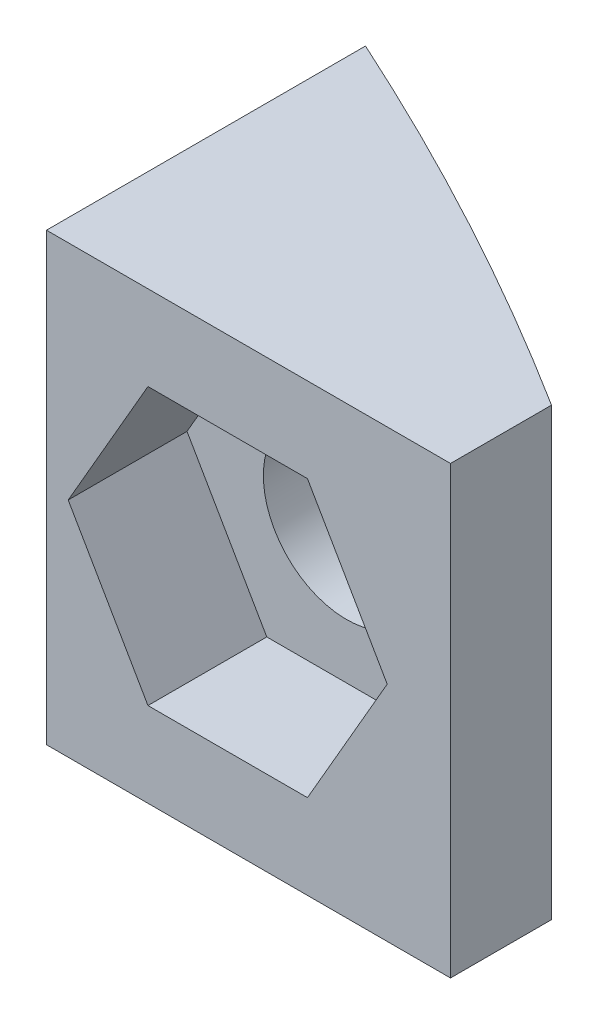
ISO-10303-21;
HEADER;
FILE_DESCRIPTION(('STEP AP214'),'2;1');
FILE_NAME('part.step','',(''),(''),'','','');
FILE_SCHEMA(('AUTOMOTIVE_DESIGN { 1 0 10303 214 1 1 1 1 }'));
ENDSEC;
DATA;
#1=APPLICATION_CONTEXT('core data for automotive mechanical design processes');
#2=APPLICATION_PROTOCOL_DEFINITION('international standard','automotive_design',2000,#1);
#3=PRODUCT_CONTEXT('',#1,'mechanical');
#4=PRODUCT('Part','Part','',(#3));
#5=PRODUCT_RELATED_PRODUCT_CATEGORY('part','',(#4));
#6=PRODUCT_DEFINITION_FORMATION('','',#4);
#7=PRODUCT_DEFINITION_CONTEXT('part definition',#1,'design');
#8=PRODUCT_DEFINITION('design','',#6,#7);
#9=PRODUCT_DEFINITION_SHAPE('','',#8);
#10=(LENGTH_UNIT() NAMED_UNIT(*) SI_UNIT(.MILLI.,.METRE.));
#11=(NAMED_UNIT(*) PLANE_ANGLE_UNIT() SI_UNIT($,.RADIAN.));
#12=(NAMED_UNIT(*) SI_UNIT($,.STERADIAN.) SOLID_ANGLE_UNIT());
#13=UNCERTAINTY_MEASURE_WITH_UNIT(LENGTH_MEASURE(1.E-05),#10,'distance_accuracy_value','');
#14=(GEOMETRIC_REPRESENTATION_CONTEXT(3) GLOBAL_UNCERTAINTY_ASSIGNED_CONTEXT((#13)) GLOBAL_UNIT_ASSIGNED_CONTEXT((#10,
#11,#12)) REPRESENTATION_CONTEXT('',''));
#15=CARTESIAN_POINT('',(0.,0.,0.));
#16=DIRECTION('',(0.,0.,1.));
#17=DIRECTION('',(1.,0.,0.));
#18=AXIS2_PLACEMENT_3D('',#15,#16,#17);
#19=CARTESIAN_POINT('',(77.47,19.05,0.));
#20=DIRECTION('',(-1.,0.,0.));
#21=DIRECTION('',(0.,0.,1.));
#22=AXIS2_PLACEMENT_3D('',#19,#20,#21);
#23=PLANE('',#22);
#24=DIRECTION('',(0.,0.,-1.));
#25=VECTOR('',#24,1.);
#26=CARTESIAN_POINT('',(77.47,0.,0.));
#27=LINE('',#26,#25);
#28=CARTESIAN_POINT('',(77.47,0.,-118.592544885295));
#29=VERTEX_POINT('',#28);
#30=CARTESIAN_POINT('',(77.47,0.,-122.910544885295));
#31=VERTEX_POINT('',#30);
#32=EDGE_CURVE('E196',#29,#31,#27,.T.);
#33=ORIENTED_EDGE('',*,*,#32,.T.);
#34=DIRECTION('',(0.,-1.,0.));
#35=VECTOR('',#34,1.);
#36=CARTESIAN_POINT('',(77.47,19.05,-122.910544885295));
#37=LINE('',#36,#35);
#38=CARTESIAN_POINT('',(77.47,19.05,-122.910544885295));
#39=VERTEX_POINT('',#38);
#40=EDGE_CURVE('E11',#39,#31,#37,.T.);
#41=ORIENTED_EDGE('',*,*,#40,.F.);
#42=DIRECTION('',(0.,0.,-1.));
#43=VECTOR('',#42,1.);
#44=CARTESIAN_POINT('',(77.47,19.05,0.));
#45=LINE('',#44,#43);
#46=CARTESIAN_POINT('',(77.47,19.05,-118.592544885295));
#47=VERTEX_POINT('',#46);
#48=EDGE_CURVE('E208',#47,#39,#45,.T.);
#49=ORIENTED_EDGE('',*,*,#48,.F.);
#50=DIRECTION('',(0.,-1.,0.));
#51=VECTOR('',#50,1.);
#52=CARTESIAN_POINT('',(77.47,19.05,-118.592544885295));
#53=LINE('',#52,#51);
#54=EDGE_CURVE('E219',#47,#29,#53,.T.);
#55=ORIENTED_EDGE('',*,*,#54,.T.);
#56=EDGE_LOOP('',(#33,#41,#49,#55));
#57=FACE_BOUND('',#56,.T.);
#58=ADVANCED_FACE('F41',(#57),#23,.F.);
#59=CARTESIAN_POINT('',(0.,19.05,0.));
#60=DIRECTION('',(0.,-1.,0.));
#61=DIRECTION('',(0.,0.,-1.));
#62=AXIS2_PLACEMENT_3D('',#59,#60,#61);
#63=CYLINDRICAL_SURFACE('',#62,145.288);
#64=CARTESIAN_POINT('',(71.5010000000001,9.525,-126.476124003703));
#65=CARTESIAN_POINT('',(71.5010001649069,9.43439620532657,-126.476123905078));
#66=CARTESIAN_POINT('',(71.4975333264599,9.34379474596496,-126.47808401275));
#67=CARTESIAN_POINT('',(71.4837113289169,9.16325660146624,-126.485896531519));
#68=CARTESIAN_POINT('',(71.4733537083806,9.07332016549213,-126.491750333473));
#69=CARTESIAN_POINT('',(71.4458634301493,8.89471383538347,-126.507279604646));
#70=CARTESIAN_POINT('',(71.4287230038121,8.80604551475931,-126.51695945599));
#71=CARTESIAN_POINT('',(71.3878907547201,8.63070749468394,-126.54000371741));
#72=CARTESIAN_POINT('',(71.3641963169206,8.54403860799085,-126.553369598203));
#73=CARTESIAN_POINT('',(71.2838802446895,8.28858846625354,-126.598638106663));
#74=CARTESIAN_POINT('',(71.2178985092768,8.12355543040999,-126.635783766397));
#75=CARTESIAN_POINT('',(71.0638760449247,7.80782916574315,-126.722279862364));
#76=CARTESIAN_POINT('',(70.9758369128121,7.65713489996581,-126.771629415102));
#77=CARTESIAN_POINT('',(70.7757713472534,7.36518932908249,-126.883438269608));
#78=CARTESIAN_POINT('',(70.6627295296353,7.22484691986981,-126.946449119097));
#79=CARTESIAN_POINT('',(70.4195018468284,6.96498051430025,-127.081533130596));
#80=CARTESIAN_POINT('',(70.2893089769108,6.84546507054279,-127.153609994745));
#81=CARTESIAN_POINT('',(69.9984161632448,6.61516858632744,-127.314003475861));
#82=CARTESIAN_POINT('',(69.8359335830389,6.50727116994737,-127.40322708678));
#83=CARTESIAN_POINT('',(69.4982947335074,6.32036309442201,-127.587722939857));
#84=CARTESIAN_POINT('',(69.3231319545769,6.24136740028041,-127.682998285662));
#85=CARTESIAN_POINT('',(68.9432897329711,6.10537570580403,-127.888535640588));
#86=CARTESIAN_POINT('',(68.7375489381928,6.05201476973421,-127.999250503989));
#87=CARTESIAN_POINT('',(68.3206521108633,5.98258429177211,-128.222257768132));
#88=CARTESIAN_POINT('',(68.1094938521993,5.96653033626387,-128.334550808513));
#89=CARTESIAN_POINT('',(67.6732945183996,5.97226455434364,-128.565130765425));
#90=CARTESIAN_POINT('',(67.4482395014602,5.99656935293641,-128.683335195357));
#91=CARTESIAN_POINT('',(67.0042731023401,6.08821895130764,-128.915060821574));
#92=CARTESIAN_POINT('',(66.7853624297083,6.15556870074474,-129.028581477683));
#93=CARTESIAN_POINT('',(66.4690596846984,6.28778384480003,-129.191644451788));
#94=CARTESIAN_POINT('',(66.3663826512842,6.33656113789001,-129.244415828261));
#95=CARTESIAN_POINT('',(66.165253530753,6.444313206469,-129.347496626411));
#96=CARTESIAN_POINT('',(66.0667993577092,6.50328287320217,-129.397807265361));
#97=CARTESIAN_POINT('',(65.8750724005428,6.63124357098046,-129.495518745455));
#98=CARTESIAN_POINT('',(65.7818003267962,6.70023597130559,-129.542919187755));
#99=CARTESIAN_POINT('',(65.6015314384539,6.8479020318045,-129.634301860454));
#100=CARTESIAN_POINT('',(65.5145308777145,6.92656983530794,-129.678286132661));
#101=CARTESIAN_POINT('',(65.3552627299218,7.08575396075117,-129.758621351409));
#102=CARTESIAN_POINT('',(65.2823731002517,7.16548137255203,-129.795303248619));
#103=CARTESIAN_POINT('',(65.1435178003256,7.33215047929023,-129.865049440799));
#104=CARTESIAN_POINT('',(65.0775482905224,7.41908812524978,-129.898115742277));
#105=CARTESIAN_POINT('',(64.9533482900191,7.59960301464737,-129.960264362442));
#106=CARTESIAN_POINT('',(64.8951142171106,7.69317715377503,-129.989348525414));
#107=CARTESIAN_POINT('',(64.7871535607639,7.8862890746596,-130.043190207701));
#108=CARTESIAN_POINT('',(64.7374258727285,7.98582607983817,-130.067948288788));
#109=CARTESIAN_POINT('',(64.6524773126145,8.17809459477088,-130.110192153503));
#110=CARTESIAN_POINT('',(64.6162410509,8.27026652931755,-130.128189271929));
#111=CARTESIAN_POINT('',(64.551431661269,8.45791094602536,-130.160350817961));
#112=CARTESIAN_POINT('',(64.5228576274202,8.55338303648916,-130.174515698668));
#113=CARTESIAN_POINT('',(64.4737564294839,8.74682433517989,-130.198841882656));
#114=CARTESIAN_POINT('',(64.4532253315,8.84479229760998,-130.20900514319));
#115=CARTESIAN_POINT('',(64.4204706939571,9.04244266290864,-130.225213516225));
#116=CARTESIAN_POINT('',(64.4082466661012,9.14212496465363,-130.231258870781));
#117=CARTESIAN_POINT('',(64.3929617120548,9.33372225325172,-130.238817140475));
#118=CARTESIAN_POINT('',(64.3892037977646,9.42556881438923,-130.240674822451));
#119=CARTESIAN_POINT('',(64.3888122699759,9.60931336192651,-130.240868388693));
#120=CARTESIAN_POINT('',(64.3921811027179,9.70121135515597,-130.239203063694));
#121=CARTESIAN_POINT('',(64.4060082269324,9.88429347525144,-130.232365829274));
#122=CARTESIAN_POINT('',(64.4164625387237,9.97547797379776,-130.22719588828));
#123=CARTESIAN_POINT('',(64.4443258938586,10.1565242222909,-130.21340958738));
#124=CARTESIAN_POINT('',(64.4617375217101,10.2463854677981,-130.204791946719));
#125=CARTESIAN_POINT('',(64.5232538989719,10.5091757417874,-130.174324574542));
#126=CARTESIAN_POINT('',(64.5769667074944,10.6794244432042,-130.147699682908));
#127=CARTESIAN_POINT('',(64.708122052126,11.0079400605016,-130.082539913609));
#128=CARTESIAN_POINT('',(64.7855676550899,11.1662054245451,-130.04400349668));
#129=CARTESIAN_POINT('',(64.9651291319094,11.4739972807232,-129.954397411063));
#130=CARTESIAN_POINT('',(65.0681700158054,11.6228461608776,-129.902856285728));
#131=CARTESIAN_POINT('',(65.2932883057748,11.9010526910054,-129.789850504962));
#132=CARTESIAN_POINT('',(65.415371894678,12.0304039835399,-129.72838262626));
#133=CARTESIAN_POINT('',(65.6864550075499,12.2783207624698,-129.59134843373));
#134=CARTESIAN_POINT('',(65.8368838442377,12.394896359386,-129.515013747476));
#135=CARTESIAN_POINT('',(66.1513649889434,12.6012689484117,-129.354671511299));
#136=CARTESIAN_POINT('',(66.3154230202549,12.6910546172431,-129.270660736471));
#137=CARTESIAN_POINT('',(66.6710972803871,12.8513055561133,-129.087612968502));
#138=CARTESIAN_POINT('',(66.86378185993,12.918665047743,-128.987930822553));
#139=CARTESIAN_POINT('',(67.2555606330689,13.0193909936629,-128.784088111445));
#140=CARTESIAN_POINT('',(67.4546576512966,13.0527422503379,-128.679925565731));
#141=CARTESIAN_POINT('',(67.8726398377826,13.0869852501667,-128.459987189422));
#142=CARTESIAN_POINT('',(68.091687521059,13.0846718095844,-128.344012430674));
#143=CARTESIAN_POINT('',(68.5260492840664,13.0399973100467,-128.112622824257));
#144=CARTESIAN_POINT('',(68.7413620048214,12.9976219733057,-127.997208190952));
#145=CARTESIAN_POINT('',(69.1695763657749,12.8712056026983,-127.766325018161));
#146=CARTESIAN_POINT('',(69.3821477385868,12.7857983110478,-127.65098778599));
#147=CARTESIAN_POINT('',(69.7903630517223,12.5733749258898,-127.428262676174));
#148=CARTESIAN_POINT('',(69.9860085428673,12.446362649523,-127.320874070372));
#149=CARTESIAN_POINT('',(70.2559677680123,12.2299976830025,-127.171977732119));
#150=CARTESIAN_POINT('',(70.340045052991,12.1558937954212,-127.125487564198));
#151=CARTESIAN_POINT('',(70.5017014008884,11.9990793761614,-127.035906498451));
#152=CARTESIAN_POINT('',(70.5792842150748,11.9163738756375,-126.992813639157));
#153=CARTESIAN_POINT('',(70.7270156066197,11.7427735770519,-126.91059596123));
#154=CARTESIAN_POINT('',(70.7971651548062,11.6518798512964,-126.871470624444));
#155=CARTESIAN_POINT('',(70.9290667534942,11.4624701724884,-126.797776555968));
#156=CARTESIAN_POINT('',(70.9908204838554,11.3639557504143,-126.763206912804));
#157=CARTESIAN_POINT('',(71.0978936270582,11.1726895441951,-126.703179739834));
#158=CARTESIAN_POINT('',(71.1443010872469,11.0807333064635,-126.677123987172));
#159=CARTESIAN_POINT('',(71.2292932587019,10.8922015814637,-126.629353247462));
#160=CARTESIAN_POINT('',(71.2678795200955,10.7956270142267,-126.607637400276));
#161=CARTESIAN_POINT('',(71.3365784116261,10.5988556032812,-126.568941994415));
#162=CARTESIAN_POINT('',(71.3667111415641,10.4986680020807,-126.551951201924));
#163=CARTESIAN_POINT('',(71.4181268802958,10.2953941125337,-126.52294247004));
#164=CARTESIAN_POINT('',(71.4394148686866,10.1923094902121,-126.510921732521));
#165=CARTESIAN_POINT('',(71.471001501924,9.9954189696889,-126.493079567178));
#166=CARTESIAN_POINT('',(71.4822370094727,9.90180993777668,-126.486729772708));
#167=CARTESIAN_POINT('',(71.4972361497104,9.71379975566086,-126.478252055283));
#168=CARTESIAN_POINT('',(71.5009998281864,9.61939861031484,-126.476124106458));
#169=CARTESIAN_POINT('',(71.5010000000001,9.525,-126.476124003703));
#170=B_SPLINE_CURVE_WITH_KNOTS('',3,(#64,#65,#66,#67,#68,#69,#70,#71,#72,#73,#74,#75,#76,#77,
#78,#79,#80,#81,#82,#83,#84,#85,#86,#87,#88,#89,#90,#91,#92,#93,#94,#95,#96,#97,#98,#99,#100,
#101,#102,#103,#104,#105,#106,#107,#108,#109,#110,#111,#112,#113,#114,#115,#116,#117,#118,#119,
#120,#121,#122,#123,#124,#125,#126,#127,#128,#129,#130,#131,#132,#133,#134,#135,#136,#137,#138,
#139,#140,#141,#142,#143,#144,#145,#146,#147,#148,#149,#150,#151,#152,#153,#154,#155,#156,#157,
#158,#159,#160,#161,#162,#163,#164,#165,#166,#167,#168,#169),.UNSPECIFIED.,.T.,.F.,(4,2,2,2,2,2,
2,2,2,2,2,2,2,2,2,2,2,2,2,2,2,2,2,2,2,2,2,2,2,2,2,2,2,2,2,2,2,2,2,2,2,2,2,2,2,2,2,2,2,2,2,2,4),
(0.,0.271719761315062,0.543536635171826,0.815665737984637,1.0879035770804,1.62994644803964,
2.17195008959383,2.74236147546937,3.31300655176737,3.95385807923089,4.59504096473342,
5.31092087290789,6.02709981291393,6.78963411567533,7.55225611661373,7.92781778572121,
8.30319175388762,8.67861705298896,9.0538162096141,9.39559272678117,9.73717859893857,
10.0786057302661,10.4199884918381,10.7215694642246,11.0231147638819,11.3245123894158,
11.6258922970005,11.9013804085138,12.1769630960646,12.452391125996,12.7279215673633,
13.2667525795589,13.8056532512222,14.3679480289913,14.9304257554286,15.5430531349073,
16.1559390875123,16.834571361364,17.5135067699773,18.2537878084265,18.9943327774655,
19.7600297352774,20.5256564622055,20.8892305610238,21.2525931857346,21.6159082945187,
21.9791506028389,22.2974413469714,22.6156689454613,22.9331333604604,23.2504187997307,
23.5335209053184,23.8166212760663),.UNSPECIFIED.);
#171=CARTESIAN_POINT('',(71.5010000000001,9.525,-126.476124003703));
#172=VERTEX_POINT('',#171);
#173=EDGE_CURVE('E159',#172,#172,#170,.T.);
#174=ORIENTED_EDGE('',*,*,#173,.F.);
#175=EDGE_LOOP('',(#174));
#176=FACE_BOUND('',#175,.T.);
#177=CARTESIAN_POINT('',(0.,0.,0.));
#178=DIRECTION('',(0.,1.,0.));
#179=DIRECTION('',(0.,0.,1.));
#180=AXIS2_PLACEMENT_3D('',#177,#178,#179);
#181=CIRCLE('',#180,145.288);
#182=CARTESIAN_POINT('',(60.198,0.,-132.230116614938));
#183=VERTEX_POINT('',#182);
#184=EDGE_CURVE('E223',#31,#183,#181,.T.);
#185=ORIENTED_EDGE('',*,*,#184,.T.);
#186=DIRECTION('',(0.,-1.,0.));
#187=VECTOR('',#186,1.);
#188=CARTESIAN_POINT('',(60.198,19.05,-132.230116614938));
#189=LINE('',#188,#187);
#190=CARTESIAN_POINT('',(60.198,19.05,-132.230116614938));
#191=VERTEX_POINT('',#190);
#192=EDGE_CURVE('E50',#191,#183,#189,.T.);
#193=ORIENTED_EDGE('',*,*,#192,.F.);
#194=CARTESIAN_POINT('',(0.,19.05,0.));
#195=DIRECTION('',(0.,1.,0.));
#196=DIRECTION('',(0.,0.,1.));
#197=AXIS2_PLACEMENT_3D('',#194,#195,#196);
#198=CIRCLE('',#197,145.288);
#199=EDGE_CURVE('E94',#39,#191,#198,.T.);
#200=ORIENTED_EDGE('',*,*,#199,.F.);
#201=ORIENTED_EDGE('',*,*,#40,.T.);
#202=EDGE_LOOP('',(#185,#193,#200,#201));
#203=FACE_BOUND('',#202,.T.);
#204=ADVANCED_FACE('F242',(#176,#203),#63,.T.);
#205=CARTESIAN_POINT('',(60.1980000000001,19.05,0.));
#206=DIRECTION('',(-1.,0.,0.));
#207=DIRECTION('',(0.,0.,1.));
#208=AXIS2_PLACEMENT_3D('',#205,#206,#207);
#209=PLANE('',#208);
#210=DIRECTION('',(0.,0.,-1.));
#211=VECTOR('',#210,1.);
#212=CARTESIAN_POINT('',(60.1980000000001,0.,0.));
#213=LINE('',#212,#211);
#214=CARTESIAN_POINT('',(60.198,0.,-118.592544885295));
#215=VERTEX_POINT('',#214);
#216=EDGE_CURVE('E227',#215,#183,#213,.T.);
#217=ORIENTED_EDGE('',*,*,#216,.F.);
#218=DIRECTION('',(0.,-1.,0.));
#219=VECTOR('',#218,1.);
#220=CARTESIAN_POINT('',(60.198,19.05,-118.592544885295));
#221=LINE('',#220,#219);
#222=CARTESIAN_POINT('',(60.198,19.05,-118.592544885295));
#223=VERTEX_POINT('',#222);
#224=EDGE_CURVE('E235',#223,#215,#221,.T.);
#225=ORIENTED_EDGE('',*,*,#224,.F.);
#226=DIRECTION('',(0.,0.,-1.));
#227=VECTOR('',#226,1.);
#228=CARTESIAN_POINT('',(60.1980000000001,19.05,0.));
#229=LINE('',#228,#227);
#230=EDGE_CURVE('E213',#223,#191,#229,.T.);
#231=ORIENTED_EDGE('',*,*,#230,.T.);
#232=ORIENTED_EDGE('',*,*,#192,.T.);
#233=EDGE_LOOP('',(#217,#225,#231,#232));
#234=FACE_BOUND('',#233,.T.);
#235=ADVANCED_FACE('F241',(#234),#209,.T.);
#236=CARTESIAN_POINT('',(0.,19.05,-118.592544885295));
#237=DIRECTION('',(0.,0.,-1.));
#238=DIRECTION('',(-1.,0.,0.));
#239=AXIS2_PLACEMENT_3D('',#236,#237,#238);
#240=PLANE('',#239);
#241=DIRECTION('',(0.499999999999999,0.866025403784439,0.));
#242=VECTOR('',#241,1.);
#243=CARTESIAN_POINT('',(51.9486170365258,-29.9925480300669,-118.592544885295));
#244=LINE('',#243,#242);
#245=CARTESIAN_POINT('',(71.3545420146994,3.6195,-118.592544885295));
#246=VERTEX_POINT('',#245);
#247=CARTESIAN_POINT('',(74.7640840293988,9.52500000000001,-118.592544885295));
#248=VERTEX_POINT('',#247);
#249=EDGE_CURVE('E179',#246,#248,#244,.T.);
#250=ORIENTED_EDGE('',*,*,#249,.F.);
#251=DIRECTION('',(1.,0.,0.));
#252=VECTOR('',#251,1.);
#253=CARTESIAN_POINT('',(0.,3.6195,-118.592544885295));
#254=LINE('',#253,#252);
#255=CARTESIAN_POINT('',(64.5354579853008,3.61950000000001,-118.592544885295));
#256=VERTEX_POINT('',#255);
#257=EDGE_CURVE('E57',#256,#246,#254,.T.);
#258=ORIENTED_EDGE('',*,*,#257,.F.);
#259=DIRECTION('',(0.500000000000001,-0.866025403784438,0.));
#260=VECTOR('',#259,1.);
#261=CARTESIAN_POINT('',(49.9688829634744,28.8495480300669,-118.592544885295));
#262=LINE('',#261,#260);
#263=CARTESIAN_POINT('',(61.1259159706014,9.525,-118.592544885295));
#264=VERTEX_POINT('',#263);
#265=EDGE_CURVE('E152',#264,#256,#262,.T.);
#266=ORIENTED_EDGE('',*,*,#265,.F.);
#267=DIRECTION('',(-0.5,-0.866025403784439,0.));
#268=VECTOR('',#267,1.);
#269=CARTESIAN_POINT('',(41.7199909924277,-24.0870480300669,-118.592544885295));
#270=LINE('',#269,#268);
#271=CARTESIAN_POINT('',(64.5354579853008,15.4305,-118.592544885295));
#272=VERTEX_POINT('',#271);
#273=EDGE_CURVE('E156',#272,#264,#270,.T.);
#274=ORIENTED_EDGE('',*,*,#273,.F.);
#275=DIRECTION('',(-1.,0.,0.));
#276=VECTOR('',#275,1.);
#277=CARTESIAN_POINT('',(0.,15.4305,-118.592544885295));
#278=LINE('',#277,#276);
#279=CARTESIAN_POINT('',(71.3545420146994,15.4305,-118.592544885295));
#280=VERTEX_POINT('',#279);
#281=EDGE_CURVE('E186',#280,#272,#278,.T.);
#282=ORIENTED_EDGE('',*,*,#281,.F.);
#283=DIRECTION('',(-0.5,0.866025403784439,0.));
#284=VECTOR('',#283,1.);
#285=CARTESIAN_POINT('',(60.1975090075725,34.7550480300669,-118.592544885295));
#286=LINE('',#285,#284);
#287=EDGE_CURVE('E182',#248,#280,#286,.T.);
#288=ORIENTED_EDGE('',*,*,#287,.F.);
#289=EDGE_LOOP('',(#250,#258,#266,#274,#282,#288));
#290=FACE_BOUND('',#289,.T.);
#291=DIRECTION('',(1.,0.,0.));
#292=VECTOR('',#291,1.);
#293=CARTESIAN_POINT('',(0.,0.,-118.592544885295));
#294=LINE('',#293,#292);
#295=EDGE_CURVE('E87',#215,#29,#294,.T.);
#296=ORIENTED_EDGE('',*,*,#295,.T.);
#297=ORIENTED_EDGE('',*,*,#54,.F.);
#298=DIRECTION('',(1.,0.,0.));
#299=VECTOR('',#298,1.);
#300=CARTESIAN_POINT('',(0.,19.05,-118.592544885295));
#301=LINE('',#300,#299);
#302=EDGE_CURVE('E66',#223,#47,#301,.T.);
#303=ORIENTED_EDGE('',*,*,#302,.F.);
#304=ORIENTED_EDGE('',*,*,#224,.T.);
#305=EDGE_LOOP('',(#296,#297,#303,#304));
#306=FACE_BOUND('',#305,.T.);
#307=ADVANCED_FACE('F249',(#290,#306),#240,.F.);
#308=CARTESIAN_POINT('',(0.,19.05,0.));
#309=DIRECTION('',(0.,1.,0.));
#310=DIRECTION('',(0.,0.,1.));
#311=AXIS2_PLACEMENT_3D('',#308,#309,#310);
#312=PLANE('',#311);
#313=ORIENTED_EDGE('',*,*,#48,.T.);
#314=ORIENTED_EDGE('',*,*,#199,.T.);
#315=ORIENTED_EDGE('',*,*,#230,.F.);
#316=ORIENTED_EDGE('',*,*,#302,.T.);
#317=EDGE_LOOP('',(#313,#314,#315,#316));
#318=FACE_BOUND('',#317,.T.);
#319=ADVANCED_FACE('F250',(#318),#312,.T.);
#320=CARTESIAN_POINT('',(0.,0.,0.));
#321=DIRECTION('',(0.,1.,0.));
#322=DIRECTION('',(0.,0.,1.));
#323=AXIS2_PLACEMENT_3D('',#320,#321,#322);
#324=PLANE('',#323);
#325=ORIENTED_EDGE('',*,*,#32,.F.);
#326=ORIENTED_EDGE('',*,*,#295,.F.);
#327=ORIENTED_EDGE('',*,*,#216,.T.);
#328=ORIENTED_EDGE('',*,*,#184,.F.);
#329=EDGE_LOOP('',(#325,#326,#327,#328));
#330=FACE_BOUND('',#329,.T.);
#331=ADVANCED_FACE('F246',(#330),#324,.F.);
#332=CARTESIAN_POINT('',(0.,3.6195,-123.672544885295));
#333=DIRECTION('',(0.,-1.,0.));
#334=DIRECTION('',(1.,0.,0.));
#335=AXIS2_PLACEMENT_3D('',#332,#333,#334);
#336=PLANE('',#335);
#337=ORIENTED_EDGE('',*,*,#257,.T.);
#338=DIRECTION('',(0.,0.,1.));
#339=VECTOR('',#338,1.);
#340=CARTESIAN_POINT('',(71.3545420146994,3.61950000000001,-123.672544885295));
#341=LINE('',#340,#339);
#342=CARTESIAN_POINT('',(71.3545420146994,3.61950000000001,-123.672544885295));
#343=VERTEX_POINT('',#342);
#344=EDGE_CURVE('E126',#343,#246,#341,.T.);
#345=ORIENTED_EDGE('',*,*,#344,.F.);
#346=DIRECTION('',(1.,0.,0.));
#347=VECTOR('',#346,1.);
#348=CARTESIAN_POINT('',(0.,3.6195,-123.672544885295));
#349=LINE('',#348,#347);
#350=CARTESIAN_POINT('',(64.5354579853008,3.61950000000001,-123.672544885295));
#351=VERTEX_POINT('',#350);
#352=EDGE_CURVE('E130',#351,#343,#349,.T.);
#353=ORIENTED_EDGE('',*,*,#352,.F.);
#354=DIRECTION('',(0.,0.,1.));
#355=VECTOR('',#354,1.);
#356=CARTESIAN_POINT('',(64.5354579853008,3.61950000000001,-123.672544885295));
#357=LINE('',#356,#355);
#358=EDGE_CURVE('E193',#351,#256,#357,.T.);
#359=ORIENTED_EDGE('',*,*,#358,.T.);
#360=EDGE_LOOP('',(#337,#345,#353,#359));
#361=FACE_BOUND('',#360,.T.);
#362=ADVANCED_FACE('F128',(#361),#336,.F.);
#363=CARTESIAN_POINT('',(49.9688829634744,28.8495480300669,-123.672544885295));
#364=DIRECTION('',(-0.866025403784438,-0.500000000000001,0.));
#365=DIRECTION('',(0.500000000000001,-0.866025403784438,0.));
#366=AXIS2_PLACEMENT_3D('',#363,#364,#365);
#367=PLANE('',#366);
#368=ORIENTED_EDGE('',*,*,#265,.T.);
#369=ORIENTED_EDGE('',*,*,#358,.F.);
#370=DIRECTION('',(0.500000000000001,-0.866025403784438,0.));
#371=VECTOR('',#370,1.);
#372=CARTESIAN_POINT('',(49.9688829634744,28.8495480300669,-123.672544885295));
#373=LINE('',#372,#371);
#374=CARTESIAN_POINT('',(61.1259159706014,9.525,-123.672544885295));
#375=VERTEX_POINT('',#374);
#376=EDGE_CURVE('E137',#375,#351,#373,.T.);
#377=ORIENTED_EDGE('',*,*,#376,.F.);
#378=DIRECTION('',(0.,0.,1.));
#379=VECTOR('',#378,1.);
#380=CARTESIAN_POINT('',(61.1259159706014,9.525,-123.672544885295));
#381=LINE('',#380,#379);
#382=EDGE_CURVE('E197',#375,#264,#381,.T.);
#383=ORIENTED_EDGE('',*,*,#382,.T.);
#384=EDGE_LOOP('',(#368,#369,#377,#383));
#385=FACE_BOUND('',#384,.T.);
#386=ADVANCED_FACE('F290',(#385),#367,.F.);
#387=CARTESIAN_POINT('',(41.7199909924277,-24.0870480300669,-123.672544885295));
#388=DIRECTION('',(-0.866025403784439,0.5,0.));
#389=DIRECTION('',(-0.5,-0.866025403784439,0.));
#390=AXIS2_PLACEMENT_3D('',#387,#388,#389);
#391=PLANE('',#390);
#392=ORIENTED_EDGE('',*,*,#273,.T.);
#393=ORIENTED_EDGE('',*,*,#382,.F.);
#394=DIRECTION('',(-0.5,-0.866025403784439,0.));
#395=VECTOR('',#394,1.);
#396=CARTESIAN_POINT('',(41.7199909924277,-24.0870480300669,-123.672544885295));
#397=LINE('',#396,#395);
#398=CARTESIAN_POINT('',(64.5354579853008,15.4305,-123.672544885295));
#399=VERTEX_POINT('',#398);
#400=EDGE_CURVE('E172',#399,#375,#397,.T.);
#401=ORIENTED_EDGE('',*,*,#400,.F.);
#402=DIRECTION('',(0.,0.,1.));
#403=VECTOR('',#402,1.);
#404=CARTESIAN_POINT('',(64.5354579853008,15.4305,-123.672544885295));
#405=LINE('',#404,#403);
#406=EDGE_CURVE('E200',#399,#272,#405,.T.);
#407=ORIENTED_EDGE('',*,*,#406,.T.);
#408=EDGE_LOOP('',(#392,#393,#401,#407));
#409=FACE_BOUND('',#408,.T.);
#410=ADVANCED_FACE('F293',(#409),#391,.F.);
#411=CARTESIAN_POINT('',(0.,15.4305,-123.672544885295));
#412=DIRECTION('',(0.,1.,0.));
#413=DIRECTION('',(-1.,0.,0.));
#414=AXIS2_PLACEMENT_3D('',#411,#412,#413);
#415=PLANE('',#414);
#416=ORIENTED_EDGE('',*,*,#281,.T.);
#417=ORIENTED_EDGE('',*,*,#406,.F.);
#418=DIRECTION('',(-1.,0.,0.));
#419=VECTOR('',#418,1.);
#420=CARTESIAN_POINT('',(0.,15.4305,-123.672544885295));
#421=LINE('',#420,#419);
#422=CARTESIAN_POINT('',(71.3545420146994,15.4305,-123.672544885295));
#423=VERTEX_POINT('',#422);
#424=EDGE_CURVE('E168',#423,#399,#421,.T.);
#425=ORIENTED_EDGE('',*,*,#424,.F.);
#426=DIRECTION('',(0.,0.,1.));
#427=VECTOR('',#426,1.);
#428=CARTESIAN_POINT('',(71.3545420146994,15.4305,-123.672544885295));
#429=LINE('',#428,#427);
#430=EDGE_CURVE('E203',#423,#280,#429,.T.);
#431=ORIENTED_EDGE('',*,*,#430,.T.);
#432=EDGE_LOOP('',(#416,#417,#425,#431));
#433=FACE_BOUND('',#432,.T.);
#434=ADVANCED_FACE('F297',(#433),#415,.F.);
#435=CARTESIAN_POINT('',(60.1975090075725,34.7550480300669,-123.672544885295));
#436=DIRECTION('',(0.866025403784439,0.5,0.));
#437=DIRECTION('',(-0.5,0.866025403784439,0.));
#438=AXIS2_PLACEMENT_3D('',#435,#436,#437);
#439=PLANE('',#438);
#440=ORIENTED_EDGE('',*,*,#287,.T.);
#441=ORIENTED_EDGE('',*,*,#430,.F.);
#442=DIRECTION('',(-0.5,0.866025403784439,0.));
#443=VECTOR('',#442,1.);
#444=CARTESIAN_POINT('',(60.1975090075725,34.7550480300669,-123.672544885295));
#445=LINE('',#444,#443);
#446=CARTESIAN_POINT('',(74.7640840293988,9.52500000000001,-123.672544885295));
#447=VERTEX_POINT('',#446);
#448=EDGE_CURVE('E146',#447,#423,#445,.T.);
#449=ORIENTED_EDGE('',*,*,#448,.F.);
#450=DIRECTION('',(0.,0.,1.));
#451=VECTOR('',#450,1.);
#452=CARTESIAN_POINT('',(74.7640840293988,9.52500000000001,-123.672544885295));
#453=LINE('',#452,#451);
#454=EDGE_CURVE('E136',#447,#248,#453,.T.);
#455=ORIENTED_EDGE('',*,*,#454,.T.);
#456=EDGE_LOOP('',(#440,#441,#449,#455));
#457=FACE_BOUND('',#456,.T.);
#458=ADVANCED_FACE('F286',(#457),#439,.F.);
#459=CARTESIAN_POINT('',(51.9486170365258,-29.9925480300669,-123.672544885295));
#460=DIRECTION('',(0.866025403784439,-0.499999999999999,0.));
#461=DIRECTION('',(0.499999999999999,0.866025403784439,0.));
#462=AXIS2_PLACEMENT_3D('',#459,#460,#461);
#463=PLANE('',#462);
#464=ORIENTED_EDGE('',*,*,#249,.T.);
#465=ORIENTED_EDGE('',*,*,#454,.F.);
#466=DIRECTION('',(0.499999999999999,0.866025403784439,0.));
#467=VECTOR('',#466,1.);
#468=CARTESIAN_POINT('',(51.9486170365258,-29.9925480300669,-123.672544885295));
#469=LINE('',#468,#467);
#470=EDGE_CURVE('E140',#343,#447,#469,.T.);
#471=ORIENTED_EDGE('',*,*,#470,.F.);
#472=ORIENTED_EDGE('',*,*,#344,.T.);
#473=EDGE_LOOP('',(#464,#465,#471,#472));
#474=FACE_BOUND('',#473,.T.);
#475=ADVANCED_FACE('F141',(#474),#463,.F.);
#476=CARTESIAN_POINT('',(0.,0.,-123.672544885295));
#477=DIRECTION('',(0.,0.,1.));
#478=DIRECTION('',(1.,0.,0.));
#479=AXIS2_PLACEMENT_3D('',#476,#477,#478);
#480=PLANE('',#479);
#481=CARTESIAN_POINT('',(67.9450000000001,9.525,-123.672544885295));
#482=DIRECTION('',(0.,0.,1.));
#483=DIRECTION('',(1.,0.,0.));
#484=AXIS2_PLACEMENT_3D('',#481,#482,#483);
#485=CIRCLE('',#484,3.556);
#486=CARTESIAN_POINT('',(71.5010000000001,9.525,-123.672544885295));
#487=VERTEX_POINT('',#486);
#488=EDGE_CURVE('E44',#487,#487,#485,.T.);
#489=ORIENTED_EDGE('',*,*,#488,.F.);
#490=EDGE_LOOP('',(#489));
#491=FACE_BOUND('',#490,.T.);
#492=ORIENTED_EDGE('',*,*,#352,.T.);
#493=ORIENTED_EDGE('',*,*,#470,.T.);
#494=ORIENTED_EDGE('',*,*,#448,.T.);
#495=ORIENTED_EDGE('',*,*,#424,.T.);
#496=ORIENTED_EDGE('',*,*,#400,.T.);
#497=ORIENTED_EDGE('',*,*,#376,.T.);
#498=EDGE_LOOP('',(#492,#493,#494,#495,#496,#497));
#499=FACE_BOUND('',#498,.T.);
#500=ADVANCED_FACE('F148',(#491,#499),#480,.T.);
#501=CARTESIAN_POINT('',(67.9450000000001,9.525,-132.231116614938));
#502=DIRECTION('',(0.,0.,1.));
#503=DIRECTION('',(1.,0.,0.));
#504=AXIS2_PLACEMENT_3D('',#501,#502,#503);
#505=CYLINDRICAL_SURFACE('',#504,3.556);
#506=ORIENTED_EDGE('',*,*,#488,.T.);
#507=EDGE_LOOP('',(#506));
#508=FACE_BOUND('',#507,.T.);
#509=ORIENTED_EDGE('',*,*,#173,.T.);
#510=EDGE_LOOP('',(#509));
#511=FACE_BOUND('',#510,.T.);
#512=ADVANCED_FACE('F278',(#508,#511),#505,.F.);
#513=CLOSED_SHELL('',(#58,#204,#235,#307,#319,#331,#362,#386,#410,#434,#458,#475,#500,#512));
#514=MANIFOLD_SOLID_BREP('B2',#513);
#515=ADVANCED_BREP_SHAPE_REPRESENTATION('',(#18,#514),#14);
#516=SHAPE_DEFINITION_REPRESENTATION(#9,#515);
ENDSEC;
END-ISO-10303-21;
